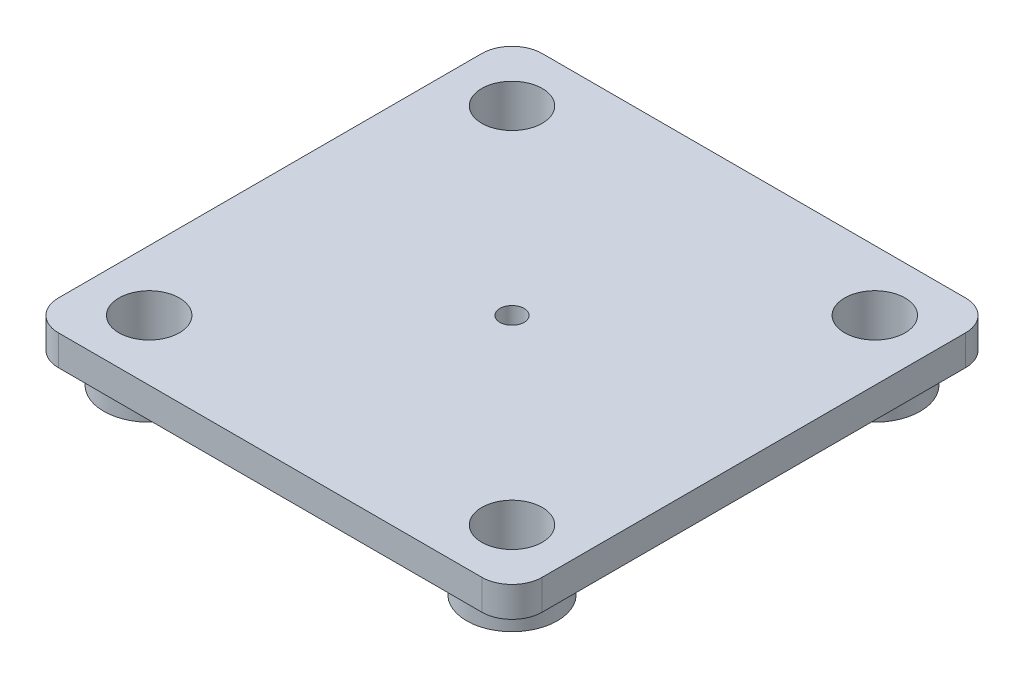
ISO-10303-21;
HEADER;
FILE_DESCRIPTION(('STEP AP214'),'2;1');
FILE_NAME('part.step','',(''),(''),'','','');
FILE_SCHEMA(('AUTOMOTIVE_DESIGN { 1 0 10303 214 1 1 1 1 }'));
ENDSEC;
DATA;
#1=APPLICATION_CONTEXT('core data for automotive mechanical design processes');
#2=APPLICATION_PROTOCOL_DEFINITION('international standard','automotive_design',2000,#1);
#3=PRODUCT_CONTEXT('',#1,'mechanical');
#4=PRODUCT('Part','Part','',(#3));
#5=PRODUCT_RELATED_PRODUCT_CATEGORY('part','',(#4));
#6=PRODUCT_DEFINITION_FORMATION('','',#4);
#7=PRODUCT_DEFINITION_CONTEXT('part definition',#1,'design');
#8=PRODUCT_DEFINITION('design','',#6,#7);
#9=PRODUCT_DEFINITION_SHAPE('','',#8);
#10=(LENGTH_UNIT() NAMED_UNIT(*) SI_UNIT(.MILLI.,.METRE.));
#11=(NAMED_UNIT(*) PLANE_ANGLE_UNIT() SI_UNIT($,.RADIAN.));
#12=(NAMED_UNIT(*) SI_UNIT($,.STERADIAN.) SOLID_ANGLE_UNIT());
#13=UNCERTAINTY_MEASURE_WITH_UNIT(LENGTH_MEASURE(1.E-05),#10,'distance_accuracy_value','');
#14=(GEOMETRIC_REPRESENTATION_CONTEXT(3) GLOBAL_UNCERTAINTY_ASSIGNED_CONTEXT((#13)) GLOBAL_UNIT_ASSIGNED_CONTEXT((#10,
#11,#12)) REPRESENTATION_CONTEXT('',''));
#15=CARTESIAN_POINT('',(0.,0.,0.));
#16=DIRECTION('',(0.,0.,1.));
#17=DIRECTION('',(1.,0.,0.));
#18=AXIS2_PLACEMENT_3D('',#15,#16,#17);
#19=CARTESIAN_POINT('',(0.,0.,0.));
#20=DIRECTION('',(0.,1.,0.));
#21=DIRECTION('',(0.,0.,1.));
#22=AXIS2_PLACEMENT_3D('',#19,#20,#21);
#23=PLANE('',#22);
#24=CARTESIAN_POINT('',(0.,0.,0.));
#25=DIRECTION('',(0.,1.,0.));
#26=DIRECTION('',(0.,0.,1.));
#27=AXIS2_PLACEMENT_3D('',#24,#25,#26);
#28=CIRCLE('',#27,2.);
#29=CARTESIAN_POINT('',(0.,0.,2.));
#30=VERTEX_POINT('',#29);
#31=EDGE_CURVE('E246',#30,#30,#28,.T.);
#32=ORIENTED_EDGE('',*,*,#31,.T.);
#33=EDGE_LOOP('',(#32));
#34=FACE_BOUND('',#33,.T.);
#35=CARTESIAN_POINT('',(30.,0.,30.));
#36=DIRECTION('',(0.,1.,0.));
#37=DIRECTION('',(0.,0.,1.));
#38=AXIS2_PLACEMENT_3D('',#35,#36,#37);
#39=CIRCLE('',#38,7.5);
#40=CARTESIAN_POINT('',(30.,0.,37.5));
#41=VERTEX_POINT('',#40);
#42=EDGE_CURVE('E166',#41,#41,#39,.F.);
#43=ORIENTED_EDGE('',*,*,#42,.F.);
#44=EDGE_LOOP('',(#43));
#45=FACE_BOUND('',#44,.T.);
#46=CARTESIAN_POINT('',(-30.,0.,-30.));
#47=DIRECTION('',(0.,1.,0.));
#48=DIRECTION('',(0.,0.,1.));
#49=AXIS2_PLACEMENT_3D('',#46,#47,#48);
#50=CIRCLE('',#49,7.5);
#51=CARTESIAN_POINT('',(-30.,0.,-22.5));
#52=VERTEX_POINT('',#51);
#53=EDGE_CURVE('E160',#52,#52,#50,.F.);
#54=ORIENTED_EDGE('',*,*,#53,.F.);
#55=EDGE_LOOP('',(#54));
#56=FACE_BOUND('',#55,.T.);
#57=DIRECTION('',(1.,0.,0.));
#58=VECTOR('',#57,1.);
#59=CARTESIAN_POINT('',(-40.,0.,40.));
#60=LINE('',#59,#58);
#61=CARTESIAN_POINT('',(-35.,0.,40.));
#62=VERTEX_POINT('',#61);
#63=CARTESIAN_POINT('',(35.,0.,40.));
#64=VERTEX_POINT('',#63);
#65=EDGE_CURVE('E141',#62,#64,#60,.T.);
#66=ORIENTED_EDGE('',*,*,#65,.F.);
#67=CARTESIAN_POINT('',(-35.,0.,35.));
#68=DIRECTION('',(0.,1.,0.));
#69=DIRECTION('',(0.,0.,1.));
#70=AXIS2_PLACEMENT_3D('',#67,#68,#69);
#71=CIRCLE('',#70,5.);
#72=CARTESIAN_POINT('',(-40.,0.,35.));
#73=VERTEX_POINT('',#72);
#74=EDGE_CURVE('E124',#62,#73,#71,.F.);
#75=ORIENTED_EDGE('',*,*,#74,.T.);
#76=DIRECTION('',(0.,0.,1.));
#77=VECTOR('',#76,1.);
#78=CARTESIAN_POINT('',(-40.,0.,-40.));
#79=LINE('',#78,#77);
#80=CARTESIAN_POINT('',(-40.,0.,-35.));
#81=VERTEX_POINT('',#80);
#82=EDGE_CURVE('E152',#81,#73,#79,.T.);
#83=ORIENTED_EDGE('',*,*,#82,.F.);
#84=CARTESIAN_POINT('',(-35.,0.,-35.));
#85=DIRECTION('',(0.,1.,0.));
#86=DIRECTION('',(0.,0.,1.));
#87=AXIS2_PLACEMENT_3D('',#84,#85,#86);
#88=CIRCLE('',#87,5.);
#89=CARTESIAN_POINT('',(-35.,0.,-40.));
#90=VERTEX_POINT('',#89);
#91=EDGE_CURVE('E135',#81,#90,#88,.F.);
#92=ORIENTED_EDGE('',*,*,#91,.T.);
#93=DIRECTION('',(-1.,0.,0.));
#94=VECTOR('',#93,1.);
#95=CARTESIAN_POINT('',(-40.,0.,-40.));
#96=LINE('',#95,#94);
#97=CARTESIAN_POINT('',(35.,0.,-40.));
#98=VERTEX_POINT('',#97);
#99=EDGE_CURVE('E156',#98,#90,#96,.T.);
#100=ORIENTED_EDGE('',*,*,#99,.F.);
#101=CARTESIAN_POINT('',(35.,0.,-35.));
#102=DIRECTION('',(0.,1.,0.));
#103=DIRECTION('',(0.,0.,1.));
#104=AXIS2_PLACEMENT_3D('',#101,#102,#103);
#105=CIRCLE('',#104,5.);
#106=CARTESIAN_POINT('',(40.,0.,-35.));
#107=VERTEX_POINT('',#106);
#108=EDGE_CURVE('E145',#98,#107,#105,.F.);
#109=ORIENTED_EDGE('',*,*,#108,.T.);
#110=DIRECTION('',(0.,0.,-1.));
#111=VECTOR('',#110,1.);
#112=CARTESIAN_POINT('',(40.,0.,-40.));
#113=LINE('',#112,#111);
#114=CARTESIAN_POINT('',(40.,0.,35.));
#115=VERTEX_POINT('',#114);
#116=EDGE_CURVE('E195',#115,#107,#113,.T.);
#117=ORIENTED_EDGE('',*,*,#116,.F.);
#118=CARTESIAN_POINT('',(35.,0.,35.));
#119=DIRECTION('',(0.,1.,0.));
#120=DIRECTION('',(0.,0.,1.));
#121=AXIS2_PLACEMENT_3D('',#118,#119,#120);
#122=CIRCLE('',#121,5.);
#123=EDGE_CURVE('E150',#115,#64,#122,.F.);
#124=ORIENTED_EDGE('',*,*,#123,.T.);
#125=EDGE_LOOP('',(#66,#75,#83,#92,#100,#109,#117,#124));
#126=FACE_BOUND('',#125,.T.);
#127=CARTESIAN_POINT('',(30.,0.,-30.));
#128=DIRECTION('',(0.,1.,0.));
#129=DIRECTION('',(0.,0.,1.));
#130=AXIS2_PLACEMENT_3D('',#127,#128,#129);
#131=CIRCLE('',#130,7.50000000000001);
#132=CARTESIAN_POINT('',(30.,0.,-22.5));
#133=VERTEX_POINT('',#132);
#134=EDGE_CURVE('E163',#133,#133,#131,.F.);
#135=ORIENTED_EDGE('',*,*,#134,.F.);
#136=EDGE_LOOP('',(#135));
#137=FACE_BOUND('',#136,.T.);
#138=CARTESIAN_POINT('',(-30.,0.,30.));
#139=DIRECTION('',(0.,1.,0.));
#140=DIRECTION('',(0.,0.,1.));
#141=AXIS2_PLACEMENT_3D('',#138,#139,#140);
#142=CIRCLE('',#141,7.5);
#143=CARTESIAN_POINT('',(-30.,0.,37.5));
#144=VERTEX_POINT('',#143);
#145=EDGE_CURVE('E169',#144,#144,#142,.F.);
#146=ORIENTED_EDGE('',*,*,#145,.F.);
#147=EDGE_LOOP('',(#146));
#148=FACE_BOUND('',#147,.T.);
#149=ADVANCED_FACE('F57',(#34,#45,#56,#126,#137,#148),#23,.F.);
#150=CARTESIAN_POINT('',(0.,5.,0.));
#151=DIRECTION('',(0.,1.,0.));
#152=DIRECTION('',(0.,0.,1.));
#153=AXIS2_PLACEMENT_3D('',#150,#151,#152);
#154=PLANE('',#153);
#155=CARTESIAN_POINT('',(0.,5.,0.));
#156=DIRECTION('',(0.,1.,0.));
#157=DIRECTION('',(0.,0.,1.));
#158=AXIS2_PLACEMENT_3D('',#155,#156,#157);
#159=CIRCLE('',#158,2.);
#160=CARTESIAN_POINT('',(0.,5.,2.));
#161=VERTEX_POINT('',#160);
#162=EDGE_CURVE('E249',#161,#161,#159,.T.);
#163=ORIENTED_EDGE('',*,*,#162,.F.);
#164=EDGE_LOOP('',(#163));
#165=FACE_BOUND('',#164,.T.);
#166=CARTESIAN_POINT('',(30.,5.,30.));
#167=DIRECTION('',(0.,1.,0.));
#168=DIRECTION('',(0.,0.,1.));
#169=AXIS2_PLACEMENT_3D('',#166,#167,#168);
#170=CIRCLE('',#169,5.);
#171=CARTESIAN_POINT('',(30.,5.,35.));
#172=VERTEX_POINT('',#171);
#173=EDGE_CURVE('E216',#172,#172,#170,.T.);
#174=ORIENTED_EDGE('',*,*,#173,.F.);
#175=EDGE_LOOP('',(#174));
#176=FACE_BOUND('',#175,.T.);
#177=CARTESIAN_POINT('',(-30.,5.,-30.));
#178=DIRECTION('',(0.,1.,0.));
#179=DIRECTION('',(0.,0.,1.));
#180=AXIS2_PLACEMENT_3D('',#177,#178,#179);
#181=CIRCLE('',#180,5.);
#182=CARTESIAN_POINT('',(-30.,5.,-25.));
#183=VERTEX_POINT('',#182);
#184=EDGE_CURVE('E204',#183,#183,#181,.T.);
#185=ORIENTED_EDGE('',*,*,#184,.F.);
#186=EDGE_LOOP('',(#185));
#187=FACE_BOUND('',#186,.T.);
#188=DIRECTION('',(0.,0.,1.));
#189=VECTOR('',#188,1.);
#190=CARTESIAN_POINT('',(-40.,5.,-40.));
#191=LINE('',#190,#189);
#192=CARTESIAN_POINT('',(-40.,5.,-35.));
#193=VERTEX_POINT('',#192);
#194=CARTESIAN_POINT('',(-40.,5.,35.));
#195=VERTEX_POINT('',#194);
#196=EDGE_CURVE('E208',#193,#195,#191,.T.);
#197=ORIENTED_EDGE('',*,*,#196,.T.);
#198=CARTESIAN_POINT('',(-35.,5.,35.));
#199=DIRECTION('',(0.,1.,0.));
#200=DIRECTION('',(0.,0.,1.));
#201=AXIS2_PLACEMENT_3D('',#198,#199,#200);
#202=CIRCLE('',#201,5.);
#203=CARTESIAN_POINT('',(-35.,5.,40.));
#204=VERTEX_POINT('',#203);
#205=EDGE_CURVE('E184',#195,#204,#202,.T.);
#206=ORIENTED_EDGE('',*,*,#205,.T.);
#207=DIRECTION('',(1.,0.,0.));
#208=VECTOR('',#207,1.);
#209=CARTESIAN_POINT('',(-40.,5.,40.));
#210=LINE('',#209,#208);
#211=CARTESIAN_POINT('',(35.,5.,40.));
#212=VERTEX_POINT('',#211);
#213=EDGE_CURVE('E144',#204,#212,#210,.T.);
#214=ORIENTED_EDGE('',*,*,#213,.T.);
#215=CARTESIAN_POINT('',(35.,5.,35.));
#216=DIRECTION('',(0.,1.,0.));
#217=DIRECTION('',(0.,0.,1.));
#218=AXIS2_PLACEMENT_3D('',#215,#216,#217);
#219=CIRCLE('',#218,5.);
#220=CARTESIAN_POINT('',(40.,5.,35.));
#221=VERTEX_POINT('',#220);
#222=EDGE_CURVE('E180',#212,#221,#219,.T.);
#223=ORIENTED_EDGE('',*,*,#222,.T.);
#224=DIRECTION('',(0.,0.,-1.));
#225=VECTOR('',#224,1.);
#226=CARTESIAN_POINT('',(40.,5.,-40.));
#227=LINE('',#226,#225);
#228=CARTESIAN_POINT('',(40.,5.,-35.));
#229=VERTEX_POINT('',#228);
#230=EDGE_CURVE('E151',#221,#229,#227,.T.);
#231=ORIENTED_EDGE('',*,*,#230,.T.);
#232=CARTESIAN_POINT('',(35.,5.,-35.));
#233=DIRECTION('',(0.,1.,0.));
#234=DIRECTION('',(0.,0.,1.));
#235=AXIS2_PLACEMENT_3D('',#232,#233,#234);
#236=CIRCLE('',#235,5.);
#237=CARTESIAN_POINT('',(35.,5.,-40.));
#238=VERTEX_POINT('',#237);
#239=EDGE_CURVE('E79',#229,#238,#236,.T.);
#240=ORIENTED_EDGE('',*,*,#239,.T.);
#241=DIRECTION('',(-1.,0.,0.));
#242=VECTOR('',#241,1.);
#243=CARTESIAN_POINT('',(-40.,5.,-40.));
#244=LINE('',#243,#242);
#245=CARTESIAN_POINT('',(-35.,5.,-40.));
#246=VERTEX_POINT('',#245);
#247=EDGE_CURVE('E154',#238,#246,#244,.T.);
#248=ORIENTED_EDGE('',*,*,#247,.T.);
#249=CARTESIAN_POINT('',(-35.,5.,-35.));
#250=DIRECTION('',(0.,1.,0.));
#251=DIRECTION('',(0.,0.,1.));
#252=AXIS2_PLACEMENT_3D('',#249,#250,#251);
#253=CIRCLE('',#252,5.);
#254=EDGE_CURVE('E182',#246,#193,#253,.T.);
#255=ORIENTED_EDGE('',*,*,#254,.T.);
#256=EDGE_LOOP('',(#197,#206,#214,#223,#231,#240,#248,#255));
#257=FACE_BOUND('',#256,.T.);
#258=CARTESIAN_POINT('',(30.,5.,-30.));
#259=DIRECTION('',(0.,1.,0.));
#260=DIRECTION('',(0.,0.,1.));
#261=AXIS2_PLACEMENT_3D('',#258,#259,#260);
#262=CIRCLE('',#261,5.00000000000001);
#263=CARTESIAN_POINT('',(30.,5.,-25.));
#264=VERTEX_POINT('',#263);
#265=EDGE_CURVE('E213',#264,#264,#262,.T.);
#266=ORIENTED_EDGE('',*,*,#265,.F.);
#267=EDGE_LOOP('',(#266));
#268=FACE_BOUND('',#267,.T.);
#269=CARTESIAN_POINT('',(-30.,5.,30.));
#270=DIRECTION('',(0.,1.,0.));
#271=DIRECTION('',(0.,0.,1.));
#272=AXIS2_PLACEMENT_3D('',#269,#270,#271);
#273=CIRCLE('',#272,5.);
#274=CARTESIAN_POINT('',(-30.,5.,35.));
#275=VERTEX_POINT('',#274);
#276=EDGE_CURVE('E219',#275,#275,#273,.T.);
#277=ORIENTED_EDGE('',*,*,#276,.F.);
#278=EDGE_LOOP('',(#277));
#279=FACE_BOUND('',#278,.T.);
#280=ADVANCED_FACE('F198',(#165,#176,#187,#257,#268,#279),#154,.T.);
#281=CARTESIAN_POINT('',(40.,5.,-40.));
#282=DIRECTION('',(-1.,0.,0.));
#283=DIRECTION('',(0.,0.,1.));
#284=AXIS2_PLACEMENT_3D('',#281,#282,#283);
#285=PLANE('',#284);
#286=ORIENTED_EDGE('',*,*,#230,.F.);
#287=DIRECTION('',(0.,-1.,0.));
#288=VECTOR('',#287,1.);
#289=CARTESIAN_POINT('',(40.,5.,35.));
#290=LINE('',#289,#288);
#291=EDGE_CURVE('E12',#221,#115,#290,.T.);
#292=ORIENTED_EDGE('',*,*,#291,.T.);
#293=ORIENTED_EDGE('',*,*,#116,.T.);
#294=DIRECTION('',(0.,-1.,0.));
#295=VECTOR('',#294,1.);
#296=CARTESIAN_POINT('',(40.,5.,-35.));
#297=LINE('',#296,#295);
#298=EDGE_CURVE('E65',#107,#229,#297,.F.);
#299=ORIENTED_EDGE('',*,*,#298,.T.);
#300=EDGE_LOOP('',(#286,#292,#293,#299));
#301=FACE_BOUND('',#300,.T.);
#302=ADVANCED_FACE('F193',(#301),#285,.F.);
#303=CARTESIAN_POINT('',(-40.,5.,-40.));
#304=DIRECTION('',(0.,0.,1.));
#305=DIRECTION('',(1.,0.,0.));
#306=AXIS2_PLACEMENT_3D('',#303,#304,#305);
#307=PLANE('',#306);
#308=ORIENTED_EDGE('',*,*,#99,.T.);
#309=DIRECTION('',(0.,-1.,0.));
#310=VECTOR('',#309,1.);
#311=CARTESIAN_POINT('',(-35.,5.,-40.));
#312=LINE('',#311,#310);
#313=EDGE_CURVE('E72',#90,#246,#312,.F.);
#314=ORIENTED_EDGE('',*,*,#313,.T.);
#315=ORIENTED_EDGE('',*,*,#247,.F.);
#316=DIRECTION('',(0.,-1.,0.));
#317=VECTOR('',#316,1.);
#318=CARTESIAN_POINT('',(35.,5.,-40.));
#319=LINE('',#318,#317);
#320=EDGE_CURVE('E186',#238,#98,#319,.T.);
#321=ORIENTED_EDGE('',*,*,#320,.T.);
#322=EDGE_LOOP('',(#308,#314,#315,#321));
#323=FACE_BOUND('',#322,.T.);
#324=ADVANCED_FACE('F203',(#323),#307,.F.);
#325=CARTESIAN_POINT('',(-40.,5.,-40.));
#326=DIRECTION('',(1.,0.,0.));
#327=DIRECTION('',(0.,0.,-1.));
#328=AXIS2_PLACEMENT_3D('',#325,#326,#327);
#329=PLANE('',#328);
#330=ORIENTED_EDGE('',*,*,#82,.T.);
#331=DIRECTION('',(0.,-1.,0.));
#332=VECTOR('',#331,1.);
#333=CARTESIAN_POINT('',(-40.,5.,35.));
#334=LINE('',#333,#332);
#335=EDGE_CURVE('E129',#73,#195,#334,.F.);
#336=ORIENTED_EDGE('',*,*,#335,.T.);
#337=ORIENTED_EDGE('',*,*,#196,.F.);
#338=DIRECTION('',(0.,-1.,0.));
#339=VECTOR('',#338,1.);
#340=CARTESIAN_POINT('',(-40.,5.,-35.));
#341=LINE('',#340,#339);
#342=EDGE_CURVE('E134',#193,#81,#341,.T.);
#343=ORIENTED_EDGE('',*,*,#342,.T.);
#344=EDGE_LOOP('',(#330,#336,#337,#343));
#345=FACE_BOUND('',#344,.T.);
#346=ADVANCED_FACE('F296',(#345),#329,.F.);
#347=CARTESIAN_POINT('',(-40.,5.,40.));
#348=DIRECTION('',(0.,0.,-1.));
#349=DIRECTION('',(-1.,0.,0.));
#350=AXIS2_PLACEMENT_3D('',#347,#348,#349);
#351=PLANE('',#350);
#352=ORIENTED_EDGE('',*,*,#213,.F.);
#353=DIRECTION('',(0.,-1.,0.));
#354=VECTOR('',#353,1.);
#355=CARTESIAN_POINT('',(-35.,5.,40.));
#356=LINE('',#355,#354);
#357=EDGE_CURVE('E128',#204,#62,#356,.T.);
#358=ORIENTED_EDGE('',*,*,#357,.T.);
#359=ORIENTED_EDGE('',*,*,#65,.T.);
#360=DIRECTION('',(0.,-1.,0.));
#361=VECTOR('',#360,1.);
#362=CARTESIAN_POINT('',(35.,5.,40.));
#363=LINE('',#362,#361);
#364=EDGE_CURVE('E146',#64,#212,#363,.F.);
#365=ORIENTED_EDGE('',*,*,#364,.T.);
#366=EDGE_LOOP('',(#352,#358,#359,#365));
#367=FACE_BOUND('',#366,.T.);
#368=ADVANCED_FACE('F140',(#367),#351,.F.);
#369=CARTESIAN_POINT('',(-30.,5.,-30.));
#370=DIRECTION('',(0.,-1.,0.));
#371=DIRECTION('',(0.,0.,-1.));
#372=AXIS2_PLACEMENT_3D('',#369,#370,#371);
#373=CYLINDRICAL_SURFACE('',#372,5.);
#374=ORIENTED_EDGE('',*,*,#184,.T.);
#375=EDGE_LOOP('',(#374));
#376=FACE_BOUND('',#375,.T.);
#377=CARTESIAN_POINT('',(-30.,-5.,-30.));
#378=DIRECTION('',(0.,-1.,0.));
#379=DIRECTION('',(0.,0.,-1.));
#380=AXIS2_PLACEMENT_3D('',#377,#378,#379);
#381=CIRCLE('',#380,5.);
#382=CARTESIAN_POINT('',(-30.,-5.,-35.));
#383=VERTEX_POINT('',#382);
#384=EDGE_CURVE('E225',#383,#383,#381,.T.);
#385=ORIENTED_EDGE('',*,*,#384,.T.);
#386=EDGE_LOOP('',(#385));
#387=FACE_BOUND('',#386,.T.);
#388=ADVANCED_FACE('F263',(#376,#387),#373,.F.);
#389=CARTESIAN_POINT('',(30.,5.,-30.));
#390=DIRECTION('',(0.,-1.,0.));
#391=DIRECTION('',(0.,0.,-1.));
#392=AXIS2_PLACEMENT_3D('',#389,#390,#391);
#393=CYLINDRICAL_SURFACE('',#392,5.00000000000001);
#394=ORIENTED_EDGE('',*,*,#265,.T.);
#395=EDGE_LOOP('',(#394));
#396=FACE_BOUND('',#395,.T.);
#397=CARTESIAN_POINT('',(30.,-5.,-30.));
#398=DIRECTION('',(0.,-1.,0.));
#399=DIRECTION('',(0.,0.,-1.));
#400=AXIS2_PLACEMENT_3D('',#397,#398,#399);
#401=CIRCLE('',#400,5.);
#402=CARTESIAN_POINT('',(30.,-5.,-35.));
#403=VERTEX_POINT('',#402);
#404=EDGE_CURVE('E231',#403,#403,#401,.T.);
#405=ORIENTED_EDGE('',*,*,#404,.T.);
#406=EDGE_LOOP('',(#405));
#407=FACE_BOUND('',#406,.T.);
#408=ADVANCED_FACE('F266',(#396,#407),#393,.F.);
#409=CARTESIAN_POINT('',(30.,5.,30.));
#410=DIRECTION('',(0.,-1.,0.));
#411=DIRECTION('',(0.,0.,-1.));
#412=AXIS2_PLACEMENT_3D('',#409,#410,#411);
#413=CYLINDRICAL_SURFACE('',#412,5.);
#414=ORIENTED_EDGE('',*,*,#173,.T.);
#415=EDGE_LOOP('',(#414));
#416=FACE_BOUND('',#415,.T.);
#417=CARTESIAN_POINT('',(30.,-5.,30.));
#418=DIRECTION('',(0.,-1.,0.));
#419=DIRECTION('',(0.,0.,-1.));
#420=AXIS2_PLACEMENT_3D('',#417,#418,#419);
#421=CIRCLE('',#420,5.);
#422=CARTESIAN_POINT('',(30.,-5.,25.));
#423=VERTEX_POINT('',#422);
#424=EDGE_CURVE('E237',#423,#423,#421,.T.);
#425=ORIENTED_EDGE('',*,*,#424,.T.);
#426=EDGE_LOOP('',(#425));
#427=FACE_BOUND('',#426,.T.);
#428=ADVANCED_FACE('F283',(#416,#427),#413,.F.);
#429=CARTESIAN_POINT('',(-30.,5.,30.));
#430=DIRECTION('',(0.,-1.,0.));
#431=DIRECTION('',(0.,0.,-1.));
#432=AXIS2_PLACEMENT_3D('',#429,#430,#431);
#433=CYLINDRICAL_SURFACE('',#432,5.);
#434=ORIENTED_EDGE('',*,*,#276,.T.);
#435=EDGE_LOOP('',(#434));
#436=FACE_BOUND('',#435,.T.);
#437=CARTESIAN_POINT('',(-30.,-5.,30.));
#438=DIRECTION('',(0.,-1.,0.));
#439=DIRECTION('',(0.,0.,-1.));
#440=AXIS2_PLACEMENT_3D('',#437,#438,#439);
#441=CIRCLE('',#440,5.);
#442=CARTESIAN_POINT('',(-30.,-5.,25.));
#443=VERTEX_POINT('',#442);
#444=EDGE_CURVE('E243',#443,#443,#441,.T.);
#445=ORIENTED_EDGE('',*,*,#444,.T.);
#446=EDGE_LOOP('',(#445));
#447=FACE_BOUND('',#446,.T.);
#448=ADVANCED_FACE('F273',(#436,#447),#433,.F.);
#449=CARTESIAN_POINT('',(-30.,-5.,-30.));
#450=DIRECTION('',(0.,-1.,0.));
#451=DIRECTION('',(0.,0.,-1.));
#452=AXIS2_PLACEMENT_3D('',#449,#450,#451);
#453=PLANE('',#452);
#454=CARTESIAN_POINT('',(-30.,-5.,-30.));
#455=DIRECTION('',(0.,-1.,0.));
#456=DIRECTION('',(1.,0.,0.));
#457=AXIS2_PLACEMENT_3D('',#454,#455,#456);
#458=CIRCLE('',#457,7.5);
#459=CARTESIAN_POINT('',(-22.5,-5.,-30.));
#460=VERTEX_POINT('',#459);
#461=EDGE_CURVE('E222',#460,#460,#458,.T.);
#462=ORIENTED_EDGE('',*,*,#461,.T.);
#463=EDGE_LOOP('',(#462));
#464=FACE_BOUND('',#463,.T.);
#465=ORIENTED_EDGE('',*,*,#384,.F.);
#466=EDGE_LOOP('',(#465));
#467=FACE_BOUND('',#466,.T.);
#468=ADVANCED_FACE('F270',(#464,#467),#453,.T.);
#469=CARTESIAN_POINT('',(-30.,-5.,-30.));
#470=DIRECTION('',(0.,1.,0.));
#471=DIRECTION('',(0.,0.,1.));
#472=AXIS2_PLACEMENT_3D('',#469,#470,#471);
#473=CYLINDRICAL_SURFACE('',#472,7.5);
#474=ORIENTED_EDGE('',*,*,#461,.F.);
#475=EDGE_LOOP('',(#474));
#476=FACE_BOUND('',#475,.T.);
#477=ORIENTED_EDGE('',*,*,#53,.T.);
#478=EDGE_LOOP('',(#477));
#479=FACE_BOUND('',#478,.T.);
#480=ADVANCED_FACE('F272',(#476,#479),#473,.T.);
#481=CARTESIAN_POINT('',(30.,-5.,-30.));
#482=DIRECTION('',(0.,-1.,0.));
#483=DIRECTION('',(0.,0.,-1.));
#484=AXIS2_PLACEMENT_3D('',#481,#482,#483);
#485=PLANE('',#484);
#486=CARTESIAN_POINT('',(30.,-5.,-30.));
#487=DIRECTION('',(0.,-1.,0.));
#488=DIRECTION('',(1.,0.,0.));
#489=AXIS2_PLACEMENT_3D('',#486,#487,#488);
#490=CIRCLE('',#489,7.50000000000001);
#491=CARTESIAN_POINT('',(37.5,-5.,-30.));
#492=VERTEX_POINT('',#491);
#493=EDGE_CURVE('E228',#492,#492,#490,.T.);
#494=ORIENTED_EDGE('',*,*,#493,.T.);
#495=EDGE_LOOP('',(#494));
#496=FACE_BOUND('',#495,.T.);
#497=ORIENTED_EDGE('',*,*,#404,.F.);
#498=EDGE_LOOP('',(#497));
#499=FACE_BOUND('',#498,.T.);
#500=ADVANCED_FACE('F280',(#496,#499),#485,.T.);
#501=CARTESIAN_POINT('',(30.,-5.,-30.));
#502=DIRECTION('',(0.,1.,0.));
#503=DIRECTION('',(0.,0.,1.));
#504=AXIS2_PLACEMENT_3D('',#501,#502,#503);
#505=CYLINDRICAL_SURFACE('',#504,7.50000000000001);
#506=ORIENTED_EDGE('',*,*,#493,.F.);
#507=EDGE_LOOP('',(#506));
#508=FACE_BOUND('',#507,.T.);
#509=ORIENTED_EDGE('',*,*,#134,.T.);
#510=EDGE_LOOP('',(#509));
#511=FACE_BOUND('',#510,.T.);
#512=ADVANCED_FACE('F421',(#508,#511),#505,.T.);
#513=CARTESIAN_POINT('',(30.,-5.,30.));
#514=DIRECTION('',(0.,-1.,0.));
#515=DIRECTION('',(0.,0.,-1.));
#516=AXIS2_PLACEMENT_3D('',#513,#514,#515);
#517=PLANE('',#516);
#518=CARTESIAN_POINT('',(30.,-5.,30.));
#519=DIRECTION('',(0.,-1.,0.));
#520=DIRECTION('',(1.,0.,0.));
#521=AXIS2_PLACEMENT_3D('',#518,#519,#520);
#522=CIRCLE('',#521,7.5);
#523=CARTESIAN_POINT('',(37.5,-5.,30.));
#524=VERTEX_POINT('',#523);
#525=EDGE_CURVE('E234',#524,#524,#522,.T.);
#526=ORIENTED_EDGE('',*,*,#525,.T.);
#527=EDGE_LOOP('',(#526));
#528=FACE_BOUND('',#527,.T.);
#529=ORIENTED_EDGE('',*,*,#424,.F.);
#530=EDGE_LOOP('',(#529));
#531=FACE_BOUND('',#530,.T.);
#532=ADVANCED_FACE('F411',(#528,#531),#517,.T.);
#533=CARTESIAN_POINT('',(30.,-5.,30.));
#534=DIRECTION('',(0.,1.,0.));
#535=DIRECTION('',(0.,0.,1.));
#536=AXIS2_PLACEMENT_3D('',#533,#534,#535);
#537=CYLINDRICAL_SURFACE('',#536,7.5);
#538=ORIENTED_EDGE('',*,*,#525,.F.);
#539=EDGE_LOOP('',(#538));
#540=FACE_BOUND('',#539,.T.);
#541=ORIENTED_EDGE('',*,*,#42,.T.);
#542=EDGE_LOOP('',(#541));
#543=FACE_BOUND('',#542,.T.);
#544=ADVANCED_FACE('F401',(#540,#543),#537,.T.);
#545=CARTESIAN_POINT('',(-30.,-5.,30.));
#546=DIRECTION('',(0.,-1.,0.));
#547=DIRECTION('',(0.,0.,-1.));
#548=AXIS2_PLACEMENT_3D('',#545,#546,#547);
#549=PLANE('',#548);
#550=CARTESIAN_POINT('',(-30.,-5.,30.));
#551=DIRECTION('',(0.,-1.,0.));
#552=DIRECTION('',(1.,0.,0.));
#553=AXIS2_PLACEMENT_3D('',#550,#551,#552);
#554=CIRCLE('',#553,7.5);
#555=CARTESIAN_POINT('',(-22.5,-5.,30.));
#556=VERTEX_POINT('',#555);
#557=EDGE_CURVE('E240',#556,#556,#554,.T.);
#558=ORIENTED_EDGE('',*,*,#557,.T.);
#559=EDGE_LOOP('',(#558));
#560=FACE_BOUND('',#559,.T.);
#561=ORIENTED_EDGE('',*,*,#444,.F.);
#562=EDGE_LOOP('',(#561));
#563=FACE_BOUND('',#562,.T.);
#564=ADVANCED_FACE('F391',(#560,#563),#549,.T.);
#565=CARTESIAN_POINT('',(-30.,-5.,30.));
#566=DIRECTION('',(0.,1.,0.));
#567=DIRECTION('',(0.,0.,1.));
#568=AXIS2_PLACEMENT_3D('',#565,#566,#567);
#569=CYLINDRICAL_SURFACE('',#568,7.5);
#570=ORIENTED_EDGE('',*,*,#557,.F.);
#571=EDGE_LOOP('',(#570));
#572=FACE_BOUND('',#571,.T.);
#573=ORIENTED_EDGE('',*,*,#145,.T.);
#574=EDGE_LOOP('',(#573));
#575=FACE_BOUND('',#574,.T.);
#576=ADVANCED_FACE('F382',(#572,#575),#569,.T.);
#577=CARTESIAN_POINT('',(0.,-5.,0.));
#578=DIRECTION('',(0.,1.,0.));
#579=DIRECTION('',(0.,0.,1.));
#580=AXIS2_PLACEMENT_3D('',#577,#578,#579);
#581=CYLINDRICAL_SURFACE('',#580,2.);
#582=ORIENTED_EDGE('',*,*,#162,.T.);
#583=EDGE_LOOP('',(#582));
#584=FACE_BOUND('',#583,.T.);
#585=ORIENTED_EDGE('',*,*,#31,.F.);
#586=EDGE_LOOP('',(#585));
#587=FACE_BOUND('',#586,.T.);
#588=ADVANCED_FACE('F253',(#584,#587),#581,.F.);
#589=CARTESIAN_POINT('',(-35.,5.,35.));
#590=DIRECTION('',(0.,-1.,0.));
#591=DIRECTION('',(0.,0.,-1.));
#592=AXIS2_PLACEMENT_3D('',#589,#590,#591);
#593=CYLINDRICAL_SURFACE('',#592,5.);
#594=ORIENTED_EDGE('',*,*,#205,.F.);
#595=ORIENTED_EDGE('',*,*,#335,.F.);
#596=ORIENTED_EDGE('',*,*,#74,.F.);
#597=ORIENTED_EDGE('',*,*,#357,.F.);
#598=EDGE_LOOP('',(#594,#595,#596,#597));
#599=FACE_BOUND('',#598,.T.);
#600=ADVANCED_FACE('F127',(#599),#593,.T.);
#601=CARTESIAN_POINT('',(-35.,5.,-35.));
#602=DIRECTION('',(0.,-1.,0.));
#603=DIRECTION('',(0.,0.,-1.));
#604=AXIS2_PLACEMENT_3D('',#601,#602,#603);
#605=CYLINDRICAL_SURFACE('',#604,5.);
#606=ORIENTED_EDGE('',*,*,#254,.F.);
#607=ORIENTED_EDGE('',*,*,#313,.F.);
#608=ORIENTED_EDGE('',*,*,#91,.F.);
#609=ORIENTED_EDGE('',*,*,#342,.F.);
#610=EDGE_LOOP('',(#606,#607,#608,#609));
#611=FACE_BOUND('',#610,.T.);
#612=ADVANCED_FACE('F306',(#611),#605,.T.);
#613=CARTESIAN_POINT('',(35.,5.,35.));
#614=DIRECTION('',(0.,-1.,0.));
#615=DIRECTION('',(0.,0.,-1.));
#616=AXIS2_PLACEMENT_3D('',#613,#614,#615);
#617=CYLINDRICAL_SURFACE('',#616,5.);
#618=ORIENTED_EDGE('',*,*,#222,.F.);
#619=ORIENTED_EDGE('',*,*,#364,.F.);
#620=ORIENTED_EDGE('',*,*,#123,.F.);
#621=ORIENTED_EDGE('',*,*,#291,.F.);
#622=EDGE_LOOP('',(#618,#619,#620,#621));
#623=FACE_BOUND('',#622,.T.);
#624=ADVANCED_FACE('F308',(#623),#617,.T.);
#625=CARTESIAN_POINT('',(35.,5.,-35.));
#626=DIRECTION('',(0.,-1.,0.));
#627=DIRECTION('',(0.,0.,-1.));
#628=AXIS2_PLACEMENT_3D('',#625,#626,#627);
#629=CYLINDRICAL_SURFACE('',#628,5.);
#630=ORIENTED_EDGE('',*,*,#239,.F.);
#631=ORIENTED_EDGE('',*,*,#298,.F.);
#632=ORIENTED_EDGE('',*,*,#108,.F.);
#633=ORIENTED_EDGE('',*,*,#320,.F.);
#634=EDGE_LOOP('',(#630,#631,#632,#633));
#635=FACE_BOUND('',#634,.T.);
#636=ADVANCED_FACE('F59',(#635),#629,.T.);
#637=CLOSED_SHELL('',(#149,#280,#302,#324,#346,#368,#388,#408,#428,#448,#468,#480,#500,#512,
#532,#544,#564,#576,#588,#600,#612,#624,#636));
#638=MANIFOLD_SOLID_BREP('B2',#637);
#639=ADVANCED_BREP_SHAPE_REPRESENTATION('',(#18,#638),#14);
#640=SHAPE_DEFINITION_REPRESENTATION(#9,#639);
ENDSEC;
END-ISO-10303-21;
